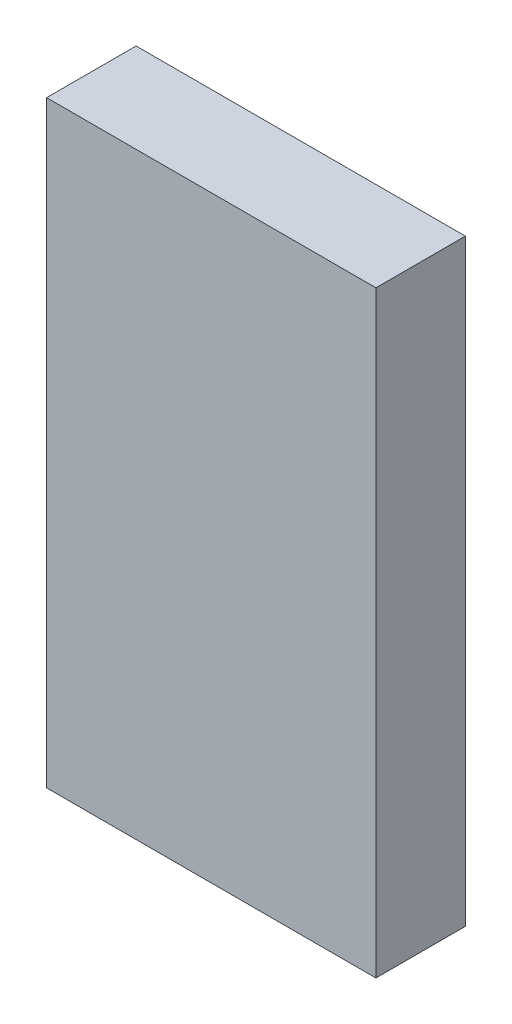
ISO-10303-21;
HEADER;
FILE_DESCRIPTION(('STEP AP214'),'2;1');
FILE_NAME('part.step','',(''),(''),'','','');
FILE_SCHEMA(('AUTOMOTIVE_DESIGN { 1 0 10303 214 1 1 1 1 }'));
ENDSEC;
DATA;
#1=APPLICATION_CONTEXT('core data for automotive mechanical design processes');
#2=APPLICATION_PROTOCOL_DEFINITION('international standard','automotive_design',2000,#1);
#3=PRODUCT_CONTEXT('',#1,'mechanical');
#4=PRODUCT('Part','Part','',(#3));
#5=PRODUCT_RELATED_PRODUCT_CATEGORY('part','',(#4));
#6=PRODUCT_DEFINITION_FORMATION('','',#4);
#7=PRODUCT_DEFINITION_CONTEXT('part definition',#1,'design');
#8=PRODUCT_DEFINITION('design','',#6,#7);
#9=PRODUCT_DEFINITION_SHAPE('','',#8);
#10=(LENGTH_UNIT() NAMED_UNIT(*) SI_UNIT(.MILLI.,.METRE.));
#11=(NAMED_UNIT(*) PLANE_ANGLE_UNIT() SI_UNIT($,.RADIAN.));
#12=(NAMED_UNIT(*) SI_UNIT($,.STERADIAN.) SOLID_ANGLE_UNIT());
#13=UNCERTAINTY_MEASURE_WITH_UNIT(LENGTH_MEASURE(1.E-05),#10,'distance_accuracy_value','');
#14=(GEOMETRIC_REPRESENTATION_CONTEXT(3) GLOBAL_UNCERTAINTY_ASSIGNED_CONTEXT((#13)) GLOBAL_UNIT_ASSIGNED_CONTEXT((#10,
#11,#12)) REPRESENTATION_CONTEXT('',''));
#15=CARTESIAN_POINT('',(0.,0.,0.));
#16=DIRECTION('',(0.,0.,1.));
#17=DIRECTION('',(1.,0.,0.));
#18=AXIS2_PLACEMENT_3D('',#15,#16,#17);
#19=CARTESIAN_POINT('',(0.806,-1.439,0.));
#20=DIRECTION('',(1.,0.,0.));
#21=DIRECTION('',(0.,0.,1.));
#22=AXIS2_PLACEMENT_3D('',#19,#20,#21);
#23=PLANE('',#22);
#24=DIRECTION('',(0.,1.,0.));
#25=VECTOR('',#24,1.);
#26=CARTESIAN_POINT('',(0.806,-1.439,0.1));
#27=LINE('',#26,#25);
#28=CARTESIAN_POINT('',(0.806,-1.439,0.1));
#29=VERTEX_POINT('',#28);
#30=CARTESIAN_POINT('',(0.806,-0.771,0.1));
#31=VERTEX_POINT('',#30);
#32=EDGE_CURVE('E11',#29,#31,#27,.T.);
#33=ORIENTED_EDGE('',*,*,#32,.T.);
#34=DIRECTION('',(0.,0.,1.));
#35=VECTOR('',#34,1.);
#36=CARTESIAN_POINT('',(0.806,-0.771,0.));
#37=LINE('',#36,#35);
#38=CARTESIAN_POINT('',(0.806,-0.771,0.));
#39=VERTEX_POINT('',#38);
#40=EDGE_CURVE('E24',#39,#31,#37,.T.);
#41=ORIENTED_EDGE('',*,*,#40,.F.);
#42=DIRECTION('',(0.,1.,0.));
#43=VECTOR('',#42,1.);
#44=CARTESIAN_POINT('',(0.806,-1.439,0.));
#45=LINE('',#44,#43);
#46=CARTESIAN_POINT('',(0.806,-1.439,0.));
#47=VERTEX_POINT('',#46);
#48=EDGE_CURVE('E86',#47,#39,#45,.T.);
#49=ORIENTED_EDGE('',*,*,#48,.F.);
#50=DIRECTION('',(0.,0.,1.));
#51=VECTOR('',#50,1.);
#52=CARTESIAN_POINT('',(0.806,-1.439,0.));
#53=LINE('',#52,#51);
#54=EDGE_CURVE('E36',#47,#29,#53,.T.);
#55=ORIENTED_EDGE('',*,*,#54,.T.);
#56=EDGE_LOOP('',(#33,#41,#49,#55));
#57=FACE_BOUND('',#56,.T.);
#58=ADVANCED_FACE('F17',(#57),#23,.F.);
#59=CARTESIAN_POINT('',(1.174,-1.439,0.));
#60=DIRECTION('',(1.,0.,0.));
#61=DIRECTION('',(0.,0.,1.));
#62=AXIS2_PLACEMENT_3D('',#59,#60,#61);
#63=PLANE('',#62);
#64=DIRECTION('',(0.,0.,1.));
#65=VECTOR('',#64,1.);
#66=CARTESIAN_POINT('',(1.174,-1.439,0.));
#67=LINE('',#66,#65);
#68=CARTESIAN_POINT('',(1.174,-1.439,0.));
#69=VERTEX_POINT('',#68);
#70=CARTESIAN_POINT('',(1.174,-1.439,0.1));
#71=VERTEX_POINT('',#70);
#72=EDGE_CURVE('E83',#69,#71,#67,.T.);
#73=ORIENTED_EDGE('',*,*,#72,.F.);
#74=DIRECTION('',(0.,1.,0.));
#75=VECTOR('',#74,1.);
#76=CARTESIAN_POINT('',(1.174,-1.439,0.));
#77=LINE('',#76,#75);
#78=CARTESIAN_POINT('',(1.174,-0.771,0.));
#79=VERTEX_POINT('',#78);
#80=EDGE_CURVE('E63',#69,#79,#77,.T.);
#81=ORIENTED_EDGE('',*,*,#80,.T.);
#82=DIRECTION('',(0.,0.,1.));
#83=VECTOR('',#82,1.);
#84=CARTESIAN_POINT('',(1.174,-0.771,0.));
#85=LINE('',#84,#83);
#86=CARTESIAN_POINT('',(1.174,-0.771,0.1));
#87=VERTEX_POINT('',#86);
#88=EDGE_CURVE('E57',#79,#87,#85,.T.);
#89=ORIENTED_EDGE('',*,*,#88,.T.);
#90=DIRECTION('',(0.,1.,0.));
#91=VECTOR('',#90,1.);
#92=CARTESIAN_POINT('',(1.174,-1.439,0.1));
#93=LINE('',#92,#91);
#94=EDGE_CURVE('E60',#71,#87,#93,.T.);
#95=ORIENTED_EDGE('',*,*,#94,.F.);
#96=EDGE_LOOP('',(#73,#81,#89,#95));
#97=FACE_BOUND('',#96,.T.);
#98=ADVANCED_FACE('F59',(#97),#63,.T.);
#99=CARTESIAN_POINT('',(0.806,-1.439,0.));
#100=DIRECTION('',(0.,1.,0.));
#101=DIRECTION('',(0.,0.,1.));
#102=AXIS2_PLACEMENT_3D('',#99,#100,#101);
#103=PLANE('',#102);
#104=ORIENTED_EDGE('',*,*,#72,.T.);
#105=DIRECTION('',(1.,0.,0.));
#106=VECTOR('',#105,1.);
#107=CARTESIAN_POINT('',(0.806,-1.439,0.1));
#108=LINE('',#107,#106);
#109=EDGE_CURVE('E71',#29,#71,#108,.T.);
#110=ORIENTED_EDGE('',*,*,#109,.F.);
#111=ORIENTED_EDGE('',*,*,#54,.F.);
#112=DIRECTION('',(1.,0.,0.));
#113=VECTOR('',#112,1.);
#114=CARTESIAN_POINT('',(0.806,-1.439,0.));
#115=LINE('',#114,#113);
#116=EDGE_CURVE('E76',#47,#69,#115,.T.);
#117=ORIENTED_EDGE('',*,*,#116,.T.);
#118=EDGE_LOOP('',(#104,#110,#111,#117));
#119=FACE_BOUND('',#118,.T.);
#120=ADVANCED_FACE('F91',(#119),#103,.F.);
#121=CARTESIAN_POINT('',(0.806,-0.771,0.));
#122=DIRECTION('',(0.,1.,0.));
#123=DIRECTION('',(0.,0.,1.));
#124=AXIS2_PLACEMENT_3D('',#121,#122,#123);
#125=PLANE('',#124);
#126=DIRECTION('',(1.,0.,0.));
#127=VECTOR('',#126,1.);
#128=CARTESIAN_POINT('',(0.806,-0.771,0.));
#129=LINE('',#128,#127);
#130=EDGE_CURVE('E74',#39,#79,#129,.T.);
#131=ORIENTED_EDGE('',*,*,#130,.F.);
#132=ORIENTED_EDGE('',*,*,#40,.T.);
#133=DIRECTION('',(1.,0.,0.));
#134=VECTOR('',#133,1.);
#135=CARTESIAN_POINT('',(0.806,-0.771,0.1));
#136=LINE('',#135,#134);
#137=EDGE_CURVE('E69',#31,#87,#136,.T.);
#138=ORIENTED_EDGE('',*,*,#137,.T.);
#139=ORIENTED_EDGE('',*,*,#88,.F.);
#140=EDGE_LOOP('',(#131,#132,#138,#139));
#141=FACE_BOUND('',#140,.T.);
#142=ADVANCED_FACE('F73',(#141),#125,.T.);
#143=CARTESIAN_POINT('',(0.806,-1.439,0.));
#144=DIRECTION('',(0.,0.,1.));
#145=DIRECTION('',(1.,0.,0.));
#146=AXIS2_PLACEMENT_3D('',#143,#144,#145);
#147=PLANE('',#146);
#148=ORIENTED_EDGE('',*,*,#130,.T.);
#149=ORIENTED_EDGE('',*,*,#80,.F.);
#150=ORIENTED_EDGE('',*,*,#116,.F.);
#151=ORIENTED_EDGE('',*,*,#48,.T.);
#152=EDGE_LOOP('',(#148,#149,#150,#151));
#153=FACE_BOUND('',#152,.T.);
#154=ADVANCED_FACE('F89',(#153),#147,.F.);
#155=CARTESIAN_POINT('',(0.806,-1.439,0.1));
#156=DIRECTION('',(0.,0.,1.));
#157=DIRECTION('',(1.,0.,0.));
#158=AXIS2_PLACEMENT_3D('',#155,#156,#157);
#159=PLANE('',#158);
#160=ORIENTED_EDGE('',*,*,#32,.F.);
#161=ORIENTED_EDGE('',*,*,#109,.T.);
#162=ORIENTED_EDGE('',*,*,#94,.T.);
#163=ORIENTED_EDGE('',*,*,#137,.F.);
#164=EDGE_LOOP('',(#160,#161,#162,#163));
#165=FACE_BOUND('',#164,.T.);
#166=ADVANCED_FACE('F68',(#165),#159,.T.);
#167=CLOSED_SHELL('',(#58,#98,#120,#142,#154,#166));
#168=MANIFOLD_SOLID_BREP('B1',#167);
#169=ADVANCED_BREP_SHAPE_REPRESENTATION('',(#18,#168),#14);
#170=SHAPE_DEFINITION_REPRESENTATION(#9,#169);
ENDSEC;
END-ISO-10303-21;
